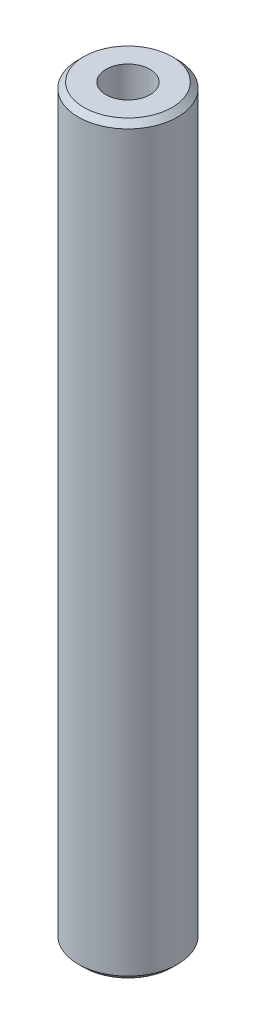
ISO-10303-21;
HEADER;
FILE_DESCRIPTION(('STEP AP214'),'2;1');
FILE_NAME('part.step','',(''),(''),'','','');
FILE_SCHEMA(('AUTOMOTIVE_DESIGN { 1 0 10303 214 1 1 1 1 }'));
ENDSEC;
DATA;
#1=APPLICATION_CONTEXT('core data for automotive mechanical design processes');
#2=APPLICATION_PROTOCOL_DEFINITION('international standard','automotive_design',2000,#1);
#3=PRODUCT_CONTEXT('',#1,'mechanical');
#4=PRODUCT('Part','Part','',(#3));
#5=PRODUCT_RELATED_PRODUCT_CATEGORY('part','',(#4));
#6=PRODUCT_DEFINITION_FORMATION('','',#4);
#7=PRODUCT_DEFINITION_CONTEXT('part definition',#1,'design');
#8=PRODUCT_DEFINITION('design','',#6,#7);
#9=PRODUCT_DEFINITION_SHAPE('','',#8);
#10=(LENGTH_UNIT() NAMED_UNIT(*) SI_UNIT(.MILLI.,.METRE.));
#11=(NAMED_UNIT(*) PLANE_ANGLE_UNIT() SI_UNIT($,.RADIAN.));
#12=(NAMED_UNIT(*) SI_UNIT($,.STERADIAN.) SOLID_ANGLE_UNIT());
#13=UNCERTAINTY_MEASURE_WITH_UNIT(LENGTH_MEASURE(1.E-05),#10,'distance_accuracy_value','');
#14=(GEOMETRIC_REPRESENTATION_CONTEXT(3) GLOBAL_UNCERTAINTY_ASSIGNED_CONTEXT((#13)) GLOBAL_UNIT_ASSIGNED_CONTEXT((#10,
#11,#12)) REPRESENTATION_CONTEXT('',''));
#15=CARTESIAN_POINT('',(0.,0.,0.));
#16=DIRECTION('',(0.,0.,1.));
#17=DIRECTION('',(1.,0.,0.));
#18=AXIS2_PLACEMENT_3D('',#15,#16,#17);
#19=CARTESIAN_POINT('',(0.,600.,0.));
#20=DIRECTION('',(0.,-1.,0.));
#21=DIRECTION('',(0.,0.,-1.));
#22=AXIS2_PLACEMENT_3D('',#19,#20,#21);
#23=CYLINDRICAL_SURFACE('',#22,40.);
#24=CARTESIAN_POINT('',(0.,595.530162617109,0.));
#25=DIRECTION('',(0.,1.,0.));
#26=DIRECTION('',(0.,0.,1.));
#27=AXIS2_PLACEMENT_3D('',#24,#25,#26);
#28=CIRCLE('',#27,40.);
#29=CARTESIAN_POINT('',(0.,595.530162617109,40.));
#30=VERTEX_POINT('',#29);
#31=EDGE_CURVE('E50',#30,#30,#28,.F.);
#32=ORIENTED_EDGE('',*,*,#31,.T.);
#33=EDGE_LOOP('',(#32));
#34=FACE_BOUND('',#33,.T.);
#35=CARTESIAN_POINT('',(0.,4.46983738289086,0.));
#36=DIRECTION('',(0.,1.,0.));
#37=DIRECTION('',(0.,0.,1.));
#38=AXIS2_PLACEMENT_3D('',#35,#36,#37);
#39=CIRCLE('',#38,40.);
#40=CARTESIAN_POINT('',(0.,4.46983738289086,40.));
#41=VERTEX_POINT('',#40);
#42=EDGE_CURVE('E51',#41,#41,#39,.T.);
#43=ORIENTED_EDGE('',*,*,#42,.T.);
#44=EDGE_LOOP('',(#43));
#45=FACE_BOUND('',#44,.T.);
#46=ADVANCED_FACE('F39',(#34,#45),#23,.T.);
#47=CARTESIAN_POINT('',(0.,600.,0.));
#48=DIRECTION('',(0.,1.,0.));
#49=DIRECTION('',(0.,0.,1.));
#50=AXIS2_PLACEMENT_3D('',#47,#48,#49);
#51=PLANE('',#50);
#52=CARTESIAN_POINT('',(0.,600.,0.));
#53=DIRECTION('',(0.,1.,0.));
#54=DIRECTION('',(0.,0.,1.));
#55=AXIS2_PLACEMENT_3D('',#52,#53,#54);
#56=CIRCLE('',#55,35.5301626171092);
#57=CARTESIAN_POINT('',(0.,600.,35.5301626171092));
#58=VERTEX_POINT('',#57);
#59=EDGE_CURVE('E54',#58,#58,#56,.T.);
#60=ORIENTED_EDGE('',*,*,#59,.T.);
#61=EDGE_LOOP('',(#60));
#62=FACE_BOUND('',#61,.T.);
#63=CARTESIAN_POINT('',(0.,600.,0.));
#64=DIRECTION('',(0.,1.,0.));
#65=DIRECTION('',(0.,0.,1.));
#66=AXIS2_PLACEMENT_3D('',#63,#64,#65);
#67=CIRCLE('',#66,17.7650960261426);
#68=CARTESIAN_POINT('',(0.,600.,17.7650960261426));
#69=VERTEX_POINT('',#68);
#70=EDGE_CURVE('E58',#69,#69,#67,.T.);
#71=ORIENTED_EDGE('',*,*,#70,.F.);
#72=EDGE_LOOP('',(#71));
#73=FACE_BOUND('',#72,.T.);
#74=ADVANCED_FACE('F69',(#62,#73),#51,.T.);
#75=CARTESIAN_POINT('',(0.,0.,0.));
#76=DIRECTION('',(0.,1.,0.));
#77=DIRECTION('',(0.,0.,1.));
#78=AXIS2_PLACEMENT_3D('',#75,#76,#77);
#79=PLANE('',#78);
#80=CARTESIAN_POINT('',(0.,0.,0.));
#81=DIRECTION('',(0.,1.,0.));
#82=DIRECTION('',(0.,0.,1.));
#83=AXIS2_PLACEMENT_3D('',#80,#81,#82);
#84=CIRCLE('',#83,35.5301626171092);
#85=CARTESIAN_POINT('',(0.,0.,35.5301626171092));
#86=VERTEX_POINT('',#85);
#87=EDGE_CURVE('E10',#86,#86,#84,.F.);
#88=ORIENTED_EDGE('',*,*,#87,.T.);
#89=EDGE_LOOP('',(#88));
#90=FACE_BOUND('',#89,.T.);
#91=CARTESIAN_POINT('',(0.,0.,0.));
#92=DIRECTION('',(0.,1.,0.));
#93=DIRECTION('',(0.,0.,1.));
#94=AXIS2_PLACEMENT_3D('',#91,#92,#93);
#95=CIRCLE('',#94,17.7650960261426);
#96=CARTESIAN_POINT('',(0.,0.,17.7650960261426));
#97=VERTEX_POINT('',#96);
#98=EDGE_CURVE('E63',#97,#97,#95,.T.);
#99=ORIENTED_EDGE('',*,*,#98,.T.);
#100=EDGE_LOOP('',(#99));
#101=FACE_BOUND('',#100,.T.);
#102=ADVANCED_FACE('F75',(#90,#101),#79,.F.);
#103=CARTESIAN_POINT('',(0.,600.,0.));
#104=DIRECTION('',(0.,-1.,0.));
#105=DIRECTION('',(0.,0.,-1.));
#106=AXIS2_PLACEMENT_3D('',#103,#104,#105);
#107=CYLINDRICAL_SURFACE('',#106,17.7650960261426);
#108=ORIENTED_EDGE('',*,*,#70,.T.);
#109=EDGE_LOOP('',(#108));
#110=FACE_BOUND('',#109,.T.);
#111=ORIENTED_EDGE('',*,*,#98,.F.);
#112=EDGE_LOOP('',(#111));
#113=FACE_BOUND('',#112,.T.);
#114=ADVANCED_FACE('F70',(#110,#113),#107,.F.);
#115=CARTESIAN_POINT('',(0.,600.,0.));
#116=DIRECTION('',(0.,-1.,0.));
#117=DIRECTION('',(0.,0.,-1.));
#118=AXIS2_PLACEMENT_3D('',#115,#116,#117);
#119=CONICAL_SURFACE('',#118,35.5301626171092,0.785398163397444);
#120=ORIENTED_EDGE('',*,*,#31,.F.);
#121=EDGE_LOOP('',(#120));
#122=FACE_BOUND('',#121,.T.);
#123=ORIENTED_EDGE('',*,*,#59,.F.);
#124=EDGE_LOOP('',(#123));
#125=FACE_BOUND('',#124,.T.);
#126=ADVANCED_FACE('F81',(#122,#125),#119,.T.);
#127=CARTESIAN_POINT('',(0.,4.46983738289086,0.));
#128=DIRECTION('',(0.,1.,0.));
#129=DIRECTION('',(0.,0.,1.));
#130=AXIS2_PLACEMENT_3D('',#127,#128,#129);
#131=CONICAL_SURFACE('',#130,40.,0.785398163397444);
#132=ORIENTED_EDGE('',*,*,#87,.F.);
#133=EDGE_LOOP('',(#132));
#134=FACE_BOUND('',#133,.T.);
#135=ORIENTED_EDGE('',*,*,#42,.F.);
#136=EDGE_LOOP('',(#135));
#137=FACE_BOUND('',#136,.T.);
#138=ADVANCED_FACE('F45',(#134,#137),#131,.T.);
#139=CLOSED_SHELL('',(#46,#74,#102,#114,#126,#138));
#140=MANIFOLD_SOLID_BREP('B2',#139);
#141=ADVANCED_BREP_SHAPE_REPRESENTATION('',(#18,#140),#14);
#142=SHAPE_DEFINITION_REPRESENTATION(#9,#141);
ENDSEC;
END-ISO-10303-21;
